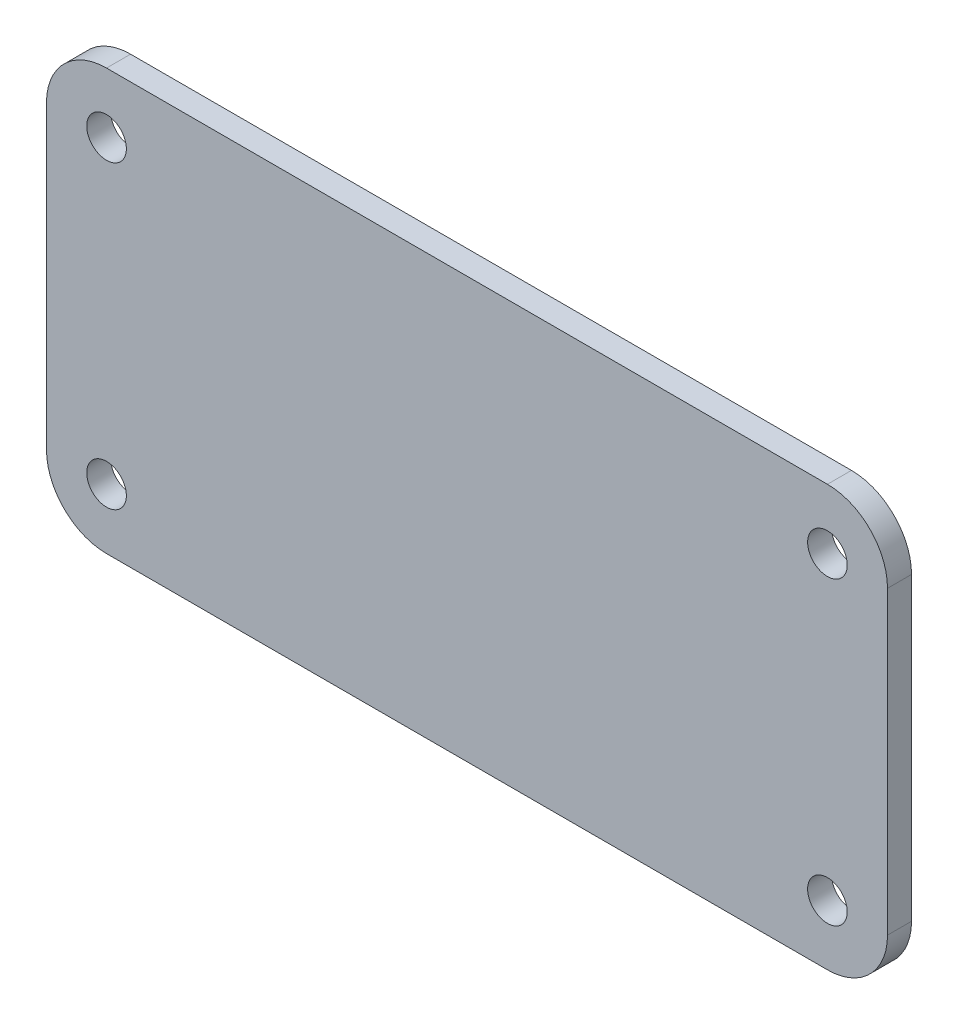
ISO-10303-21;
HEADER;
FILE_DESCRIPTION(('STEP AP214'),'2;1');
FILE_NAME('part.step','',(''),(''),'','','');
FILE_SCHEMA(('AUTOMOTIVE_DESIGN { 1 0 10303 214 1 1 1 1 }'));
ENDSEC;
DATA;
#1=APPLICATION_CONTEXT('core data for automotive mechanical design processes');
#2=APPLICATION_PROTOCOL_DEFINITION('international standard','automotive_design',2000,#1);
#3=PRODUCT_CONTEXT('',#1,'mechanical');
#4=PRODUCT('Part','Part','',(#3));
#5=PRODUCT_RELATED_PRODUCT_CATEGORY('part','',(#4));
#6=PRODUCT_DEFINITION_FORMATION('','',#4);
#7=PRODUCT_DEFINITION_CONTEXT('part definition',#1,'design');
#8=PRODUCT_DEFINITION('design','',#6,#7);
#9=PRODUCT_DEFINITION_SHAPE('','',#8);
#10=(LENGTH_UNIT() NAMED_UNIT(*) SI_UNIT(.MILLI.,.METRE.));
#11=(NAMED_UNIT(*) PLANE_ANGLE_UNIT() SI_UNIT($,.RADIAN.));
#12=(NAMED_UNIT(*) SI_UNIT($,.STERADIAN.) SOLID_ANGLE_UNIT());
#13=UNCERTAINTY_MEASURE_WITH_UNIT(LENGTH_MEASURE(1.E-05),#10,'distance_accuracy_value','');
#14=(GEOMETRIC_REPRESENTATION_CONTEXT(3) GLOBAL_UNCERTAINTY_ASSIGNED_CONTEXT((#13)) GLOBAL_UNIT_ASSIGNED_CONTEXT((#10,
#11,#12)) REPRESENTATION_CONTEXT('',''));
#15=CARTESIAN_POINT('',(0.,0.,0.));
#16=DIRECTION('',(0.,0.,1.));
#17=DIRECTION('',(1.,0.,0.));
#18=AXIS2_PLACEMENT_3D('',#15,#16,#17);
#19=CARTESIAN_POINT('',(0.,0.,2.));
#20=DIRECTION('',(1.,0.,0.));
#21=DIRECTION('',(0.,0.,-1.));
#22=AXIS2_PLACEMENT_3D('',#19,#20,#21);
#23=PLANE('',#22);
#24=DIRECTION('',(0.,-1.,0.));
#25=VECTOR('',#24,1.);
#26=CARTESIAN_POINT('',(0.,0.,0.));
#27=LINE('',#26,#25);
#28=CARTESIAN_POINT('',(0.,30.,0.));
#29=VERTEX_POINT('',#28);
#30=CARTESIAN_POINT('',(0.,5.,0.));
#31=VERTEX_POINT('',#30);
#32=EDGE_CURVE('E126',#29,#31,#27,.T.);
#33=ORIENTED_EDGE('',*,*,#32,.T.);
#34=DIRECTION('',(0.,0.,-1.));
#35=VECTOR('',#34,1.);
#36=CARTESIAN_POINT('',(0.,5.,2.));
#37=LINE('',#36,#35);
#38=CARTESIAN_POINT('',(0.,5.,2.));
#39=VERTEX_POINT('',#38);
#40=EDGE_CURVE('E104',#31,#39,#37,.F.);
#41=ORIENTED_EDGE('',*,*,#40,.T.);
#42=DIRECTION('',(0.,-1.,0.));
#43=VECTOR('',#42,1.);
#44=CARTESIAN_POINT('',(0.,0.,2.));
#45=LINE('',#44,#43);
#46=CARTESIAN_POINT('',(0.,30.,2.));
#47=VERTEX_POINT('',#46);
#48=EDGE_CURVE('E136',#47,#39,#45,.T.);
#49=ORIENTED_EDGE('',*,*,#48,.F.);
#50=DIRECTION('',(0.,0.,-1.));
#51=VECTOR('',#50,1.);
#52=CARTESIAN_POINT('',(0.,30.,2.));
#53=LINE('',#52,#51);
#54=EDGE_CURVE('E109',#47,#29,#53,.T.);
#55=ORIENTED_EDGE('',*,*,#54,.T.);
#56=EDGE_LOOP('',(#33,#41,#49,#55));
#57=FACE_BOUND('',#56,.T.);
#58=ADVANCED_FACE('F33',(#57),#23,.F.);
#59=CARTESIAN_POINT('',(0.,0.,2.));
#60=DIRECTION('',(0.,1.,0.));
#61=DIRECTION('',(0.,0.,1.));
#62=AXIS2_PLACEMENT_3D('',#59,#60,#61);
#63=PLANE('',#62);
#64=DIRECTION('',(1.,0.,0.));
#65=VECTOR('',#64,1.);
#66=CARTESIAN_POINT('',(0.,0.,2.));
#67=LINE('',#66,#65);
#68=CARTESIAN_POINT('',(5.,0.,2.));
#69=VERTEX_POINT('',#68);
#70=CARTESIAN_POINT('',(65.,0.,2.));
#71=VERTEX_POINT('',#70);
#72=EDGE_CURVE('E119',#69,#71,#67,.T.);
#73=ORIENTED_EDGE('',*,*,#72,.F.);
#74=DIRECTION('',(0.,0.,-1.));
#75=VECTOR('',#74,1.);
#76=CARTESIAN_POINT('',(5.,0.,2.));
#77=LINE('',#76,#75);
#78=CARTESIAN_POINT('',(5.,0.,0.));
#79=VERTEX_POINT('',#78);
#80=EDGE_CURVE('E103',#69,#79,#77,.T.);
#81=ORIENTED_EDGE('',*,*,#80,.T.);
#82=DIRECTION('',(1.,0.,0.));
#83=VECTOR('',#82,1.);
#84=CARTESIAN_POINT('',(0.,0.,0.));
#85=LINE('',#84,#83);
#86=CARTESIAN_POINT('',(65.,0.,0.));
#87=VERTEX_POINT('',#86);
#88=EDGE_CURVE('E116',#79,#87,#85,.T.);
#89=ORIENTED_EDGE('',*,*,#88,.T.);
#90=DIRECTION('',(0.,0.,-1.));
#91=VECTOR('',#90,1.);
#92=CARTESIAN_POINT('',(65.,0.,2.));
#93=LINE('',#92,#91);
#94=EDGE_CURVE('E121',#87,#71,#93,.F.);
#95=ORIENTED_EDGE('',*,*,#94,.T.);
#96=EDGE_LOOP('',(#73,#81,#89,#95));
#97=FACE_BOUND('',#96,.T.);
#98=ADVANCED_FACE('F115',(#97),#63,.F.);
#99=CARTESIAN_POINT('',(70.,0.,2.));
#100=DIRECTION('',(-1.,0.,0.));
#101=DIRECTION('',(0.,0.,1.));
#102=AXIS2_PLACEMENT_3D('',#99,#100,#101);
#103=PLANE('',#102);
#104=DIRECTION('',(0.,1.,0.));
#105=VECTOR('',#104,1.);
#106=CARTESIAN_POINT('',(70.,0.,2.));
#107=LINE('',#106,#105);
#108=CARTESIAN_POINT('',(70.,5.,2.));
#109=VERTEX_POINT('',#108);
#110=CARTESIAN_POINT('',(70.,30.,2.));
#111=VERTEX_POINT('',#110);
#112=EDGE_CURVE('E162',#109,#111,#107,.T.);
#113=ORIENTED_EDGE('',*,*,#112,.F.);
#114=DIRECTION('',(0.,0.,-1.));
#115=VECTOR('',#114,1.);
#116=CARTESIAN_POINT('',(70.,5.,2.));
#117=LINE('',#116,#115);
#118=CARTESIAN_POINT('',(70.,5.,0.));
#119=VERTEX_POINT('',#118);
#120=EDGE_CURVE('E155',#109,#119,#117,.T.);
#121=ORIENTED_EDGE('',*,*,#120,.T.);
#122=DIRECTION('',(0.,1.,0.));
#123=VECTOR('',#122,1.);
#124=CARTESIAN_POINT('',(70.,0.,0.));
#125=LINE('',#124,#123);
#126=CARTESIAN_POINT('',(70.,30.,0.));
#127=VERTEX_POINT('',#126);
#128=EDGE_CURVE('E125',#119,#127,#125,.T.);
#129=ORIENTED_EDGE('',*,*,#128,.T.);
#130=DIRECTION('',(0.,0.,-1.));
#131=VECTOR('',#130,1.);
#132=CARTESIAN_POINT('',(70.,30.,2.));
#133=LINE('',#132,#131);
#134=EDGE_CURVE('E153',#127,#111,#133,.F.);
#135=ORIENTED_EDGE('',*,*,#134,.T.);
#136=EDGE_LOOP('',(#113,#121,#129,#135));
#137=FACE_BOUND('',#136,.T.);
#138=ADVANCED_FACE('F160',(#137),#103,.F.);
#139=CARTESIAN_POINT('',(0.,35.,2.));
#140=DIRECTION('',(0.,-1.,0.));
#141=DIRECTION('',(0.,0.,-1.));
#142=AXIS2_PLACEMENT_3D('',#139,#140,#141);
#143=PLANE('',#142);
#144=DIRECTION('',(-1.,0.,0.));
#145=VECTOR('',#144,1.);
#146=CARTESIAN_POINT('',(0.,35.,2.));
#147=LINE('',#146,#145);
#148=CARTESIAN_POINT('',(65.,35.,2.));
#149=VERTEX_POINT('',#148);
#150=CARTESIAN_POINT('',(5.,35.,2.));
#151=VERTEX_POINT('',#150);
#152=EDGE_CURVE('E137',#149,#151,#147,.T.);
#153=ORIENTED_EDGE('',*,*,#152,.F.);
#154=DIRECTION('',(0.,0.,-1.));
#155=VECTOR('',#154,1.);
#156=CARTESIAN_POINT('',(65.,35.,2.));
#157=LINE('',#156,#155);
#158=CARTESIAN_POINT('',(65.,35.,0.));
#159=VERTEX_POINT('',#158);
#160=EDGE_CURVE('E11',#149,#159,#157,.T.);
#161=ORIENTED_EDGE('',*,*,#160,.T.);
#162=DIRECTION('',(-1.,0.,0.));
#163=VECTOR('',#162,1.);
#164=CARTESIAN_POINT('',(0.,35.,0.));
#165=LINE('',#164,#163);
#166=CARTESIAN_POINT('',(5.,35.,0.));
#167=VERTEX_POINT('',#166);
#168=EDGE_CURVE('E129',#159,#167,#165,.T.);
#169=ORIENTED_EDGE('',*,*,#168,.T.);
#170=DIRECTION('',(0.,0.,-1.));
#171=VECTOR('',#170,1.);
#172=CARTESIAN_POINT('',(5.,35.,2.));
#173=LINE('',#172,#171);
#174=EDGE_CURVE('E41',#167,#151,#173,.F.);
#175=ORIENTED_EDGE('',*,*,#174,.T.);
#176=EDGE_LOOP('',(#153,#161,#169,#175));
#177=FACE_BOUND('',#176,.T.);
#178=ADVANCED_FACE('F169',(#177),#143,.F.);
#179=CARTESIAN_POINT('',(0.,0.,2.));
#180=DIRECTION('',(0.,0.,-1.));
#181=DIRECTION('',(-1.,0.,0.));
#182=AXIS2_PLACEMENT_3D('',#179,#180,#181);
#183=PLANE('',#182);
#184=CARTESIAN_POINT('',(5.,5.,2.));
#185=DIRECTION('',(0.,0.,1.));
#186=DIRECTION('',(1.,0.,0.));
#187=AXIS2_PLACEMENT_3D('',#184,#185,#186);
#188=CIRCLE('',#187,1.65);
#189=CARTESIAN_POINT('',(6.65,5.,2.));
#190=VERTEX_POINT('',#189);
#191=EDGE_CURVE('E179',#190,#190,#188,.T.);
#192=ORIENTED_EDGE('',*,*,#191,.F.);
#193=EDGE_LOOP('',(#192));
#194=FACE_BOUND('',#193,.T.);
#195=CARTESIAN_POINT('',(65.,30.,2.));
#196=DIRECTION('',(0.,0.,1.));
#197=DIRECTION('',(1.,0.,0.));
#198=AXIS2_PLACEMENT_3D('',#195,#196,#197);
#199=CIRCLE('',#198,1.65);
#200=CARTESIAN_POINT('',(66.65,30.,2.));
#201=VERTEX_POINT('',#200);
#202=EDGE_CURVE('E185',#201,#201,#199,.T.);
#203=ORIENTED_EDGE('',*,*,#202,.F.);
#204=EDGE_LOOP('',(#203));
#205=FACE_BOUND('',#204,.T.);
#206=CARTESIAN_POINT('',(65.,5.,2.));
#207=DIRECTION('',(0.,0.,1.));
#208=DIRECTION('',(1.,0.,0.));
#209=AXIS2_PLACEMENT_3D('',#206,#207,#208);
#210=CIRCLE('',#209,1.65);
#211=CARTESIAN_POINT('',(66.65,5.,2.));
#212=VERTEX_POINT('',#211);
#213=EDGE_CURVE('E186',#212,#212,#210,.T.);
#214=ORIENTED_EDGE('',*,*,#213,.F.);
#215=EDGE_LOOP('',(#214));
#216=FACE_BOUND('',#215,.T.);
#217=CARTESIAN_POINT('',(5.,30.,2.));
#218=DIRECTION('',(0.,0.,1.));
#219=DIRECTION('',(1.,0.,0.));
#220=AXIS2_PLACEMENT_3D('',#217,#218,#219);
#221=CIRCLE('',#220,1.65);
#222=CARTESIAN_POINT('',(6.65,30.,2.));
#223=VERTEX_POINT('',#222);
#224=EDGE_CURVE('E176',#223,#223,#221,.T.);
#225=ORIENTED_EDGE('',*,*,#224,.F.);
#226=EDGE_LOOP('',(#225));
#227=FACE_BOUND('',#226,.T.);
#228=ORIENTED_EDGE('',*,*,#48,.T.);
#229=CARTESIAN_POINT('',(5.,5.,2.));
#230=DIRECTION('',(0.,0.,-1.));
#231=DIRECTION('',(-1.,0.,0.));
#232=AXIS2_PLACEMENT_3D('',#229,#230,#231);
#233=CIRCLE('',#232,5.);
#234=EDGE_CURVE('E151',#39,#69,#233,.F.);
#235=ORIENTED_EDGE('',*,*,#234,.T.);
#236=ORIENTED_EDGE('',*,*,#72,.T.);
#237=CARTESIAN_POINT('',(65.,5.,2.));
#238=DIRECTION('',(0.,0.,-1.));
#239=DIRECTION('',(-1.,0.,0.));
#240=AXIS2_PLACEMENT_3D('',#237,#238,#239);
#241=CIRCLE('',#240,5.);
#242=EDGE_CURVE('E149',#71,#109,#241,.F.);
#243=ORIENTED_EDGE('',*,*,#242,.T.);
#244=ORIENTED_EDGE('',*,*,#112,.T.);
#245=CARTESIAN_POINT('',(65.,30.,2.));
#246=DIRECTION('',(0.,0.,-1.));
#247=DIRECTION('',(-1.,0.,0.));
#248=AXIS2_PLACEMENT_3D('',#245,#246,#247);
#249=CIRCLE('',#248,5.);
#250=EDGE_CURVE('E54',#111,#149,#249,.F.);
#251=ORIENTED_EDGE('',*,*,#250,.T.);
#252=ORIENTED_EDGE('',*,*,#152,.T.);
#253=CARTESIAN_POINT('',(5.,30.,2.));
#254=DIRECTION('',(0.,0.,-1.));
#255=DIRECTION('',(-1.,0.,0.));
#256=AXIS2_PLACEMENT_3D('',#253,#254,#255);
#257=CIRCLE('',#256,5.);
#258=EDGE_CURVE('E146',#151,#47,#257,.F.);
#259=ORIENTED_EDGE('',*,*,#258,.T.);
#260=EDGE_LOOP('',(#228,#235,#236,#243,#244,#251,#252,#259));
#261=FACE_BOUND('',#260,.T.);
#262=ADVANCED_FACE('F202',(#194,#205,#216,#227,#261),#183,.F.);
#263=CARTESIAN_POINT('',(0.,0.,0.));
#264=DIRECTION('',(0.,0.,-1.));
#265=DIRECTION('',(-1.,0.,0.));
#266=AXIS2_PLACEMENT_3D('',#263,#264,#265);
#267=PLANE('',#266);
#268=CARTESIAN_POINT('',(5.,5.,0.));
#269=DIRECTION('',(0.,0.,1.));
#270=DIRECTION('',(1.,0.,0.));
#271=AXIS2_PLACEMENT_3D('',#268,#269,#270);
#272=CIRCLE('',#271,1.65);
#273=CARTESIAN_POINT('',(6.65,5.,0.));
#274=VERTEX_POINT('',#273);
#275=EDGE_CURVE('E189',#274,#274,#272,.T.);
#276=ORIENTED_EDGE('',*,*,#275,.T.);
#277=EDGE_LOOP('',(#276));
#278=FACE_BOUND('',#277,.T.);
#279=CARTESIAN_POINT('',(65.,30.,0.));
#280=DIRECTION('',(0.,0.,1.));
#281=DIRECTION('',(1.,0.,0.));
#282=AXIS2_PLACEMENT_3D('',#279,#280,#281);
#283=CIRCLE('',#282,1.65);
#284=CARTESIAN_POINT('',(66.65,30.,0.));
#285=VERTEX_POINT('',#284);
#286=EDGE_CURVE('E182',#285,#285,#283,.T.);
#287=ORIENTED_EDGE('',*,*,#286,.T.);
#288=EDGE_LOOP('',(#287));
#289=FACE_BOUND('',#288,.T.);
#290=CARTESIAN_POINT('',(65.,5.,0.));
#291=DIRECTION('',(0.,0.,1.));
#292=DIRECTION('',(1.,0.,0.));
#293=AXIS2_PLACEMENT_3D('',#290,#291,#292);
#294=CIRCLE('',#293,1.65);
#295=CARTESIAN_POINT('',(66.65,5.,0.));
#296=VERTEX_POINT('',#295);
#297=EDGE_CURVE('E194',#296,#296,#294,.T.);
#298=ORIENTED_EDGE('',*,*,#297,.T.);
#299=EDGE_LOOP('',(#298));
#300=FACE_BOUND('',#299,.T.);
#301=CARTESIAN_POINT('',(5.,30.,0.));
#302=DIRECTION('',(0.,0.,1.));
#303=DIRECTION('',(1.,0.,0.));
#304=AXIS2_PLACEMENT_3D('',#301,#302,#303);
#305=CIRCLE('',#304,1.65);
#306=CARTESIAN_POINT('',(6.65,30.,0.));
#307=VERTEX_POINT('',#306);
#308=EDGE_CURVE('E131',#307,#307,#305,.T.);
#309=ORIENTED_EDGE('',*,*,#308,.T.);
#310=EDGE_LOOP('',(#309));
#311=FACE_BOUND('',#310,.T.);
#312=ORIENTED_EDGE('',*,*,#88,.F.);
#313=CARTESIAN_POINT('',(5.,5.,0.));
#314=DIRECTION('',(0.,0.,-1.));
#315=DIRECTION('',(-1.,0.,0.));
#316=AXIS2_PLACEMENT_3D('',#313,#314,#315);
#317=CIRCLE('',#316,5.);
#318=EDGE_CURVE('E99',#79,#31,#317,.T.);
#319=ORIENTED_EDGE('',*,*,#318,.T.);
#320=ORIENTED_EDGE('',*,*,#32,.F.);
#321=CARTESIAN_POINT('',(5.,30.,0.));
#322=DIRECTION('',(0.,0.,-1.));
#323=DIRECTION('',(-1.,0.,0.));
#324=AXIS2_PLACEMENT_3D('',#321,#322,#323);
#325=CIRCLE('',#324,5.);
#326=EDGE_CURVE('E120',#29,#167,#325,.T.);
#327=ORIENTED_EDGE('',*,*,#326,.T.);
#328=ORIENTED_EDGE('',*,*,#168,.F.);
#329=CARTESIAN_POINT('',(65.,30.,0.));
#330=DIRECTION('',(0.,0.,-1.));
#331=DIRECTION('',(-1.,0.,0.));
#332=AXIS2_PLACEMENT_3D('',#329,#330,#331);
#333=CIRCLE('',#332,5.);
#334=EDGE_CURVE('E140',#159,#127,#333,.T.);
#335=ORIENTED_EDGE('',*,*,#334,.T.);
#336=ORIENTED_EDGE('',*,*,#128,.F.);
#337=CARTESIAN_POINT('',(65.,5.,0.));
#338=DIRECTION('',(0.,0.,-1.));
#339=DIRECTION('',(-1.,0.,0.));
#340=AXIS2_PLACEMENT_3D('',#337,#338,#339);
#341=CIRCLE('',#340,5.);
#342=EDGE_CURVE('E110',#119,#87,#341,.T.);
#343=ORIENTED_EDGE('',*,*,#342,.T.);
#344=EDGE_LOOP('',(#312,#319,#320,#327,#328,#335,#336,#343));
#345=FACE_BOUND('',#344,.T.);
#346=ADVANCED_FACE('F123',(#278,#289,#300,#311,#345),#267,.T.);
#347=CARTESIAN_POINT('',(5.,5.,2.));
#348=DIRECTION('',(0.,0.,-1.));
#349=DIRECTION('',(-1.,0.,0.));
#350=AXIS2_PLACEMENT_3D('',#347,#348,#349);
#351=CYLINDRICAL_SURFACE('',#350,5.);
#352=ORIENTED_EDGE('',*,*,#234,.F.);
#353=ORIENTED_EDGE('',*,*,#40,.F.);
#354=ORIENTED_EDGE('',*,*,#318,.F.);
#355=ORIENTED_EDGE('',*,*,#80,.F.);
#356=EDGE_LOOP('',(#352,#353,#354,#355));
#357=FACE_BOUND('',#356,.T.);
#358=ADVANCED_FACE('F102',(#357),#351,.T.);
#359=CARTESIAN_POINT('',(65.,5.,2.));
#360=DIRECTION('',(0.,0.,-1.));
#361=DIRECTION('',(-1.,0.,0.));
#362=AXIS2_PLACEMENT_3D('',#359,#360,#361);
#363=CYLINDRICAL_SURFACE('',#362,5.);
#364=ORIENTED_EDGE('',*,*,#242,.F.);
#365=ORIENTED_EDGE('',*,*,#94,.F.);
#366=ORIENTED_EDGE('',*,*,#342,.F.);
#367=ORIENTED_EDGE('',*,*,#120,.F.);
#368=EDGE_LOOP('',(#364,#365,#366,#367));
#369=FACE_BOUND('',#368,.T.);
#370=ADVANCED_FACE('F220',(#369),#363,.T.);
#371=CARTESIAN_POINT('',(65.,30.,2.));
#372=DIRECTION('',(0.,0.,-1.));
#373=DIRECTION('',(-1.,0.,0.));
#374=AXIS2_PLACEMENT_3D('',#371,#372,#373);
#375=CYLINDRICAL_SURFACE('',#374,5.);
#376=ORIENTED_EDGE('',*,*,#250,.F.);
#377=ORIENTED_EDGE('',*,*,#134,.F.);
#378=ORIENTED_EDGE('',*,*,#334,.F.);
#379=ORIENTED_EDGE('',*,*,#160,.F.);
#380=EDGE_LOOP('',(#376,#377,#378,#379));
#381=FACE_BOUND('',#380,.T.);
#382=ADVANCED_FACE('F168',(#381),#375,.T.);
#383=CARTESIAN_POINT('',(5.,30.,2.));
#384=DIRECTION('',(0.,0.,-1.));
#385=DIRECTION('',(-1.,0.,0.));
#386=AXIS2_PLACEMENT_3D('',#383,#384,#385);
#387=CYLINDRICAL_SURFACE('',#386,5.);
#388=ORIENTED_EDGE('',*,*,#258,.F.);
#389=ORIENTED_EDGE('',*,*,#174,.F.);
#390=ORIENTED_EDGE('',*,*,#326,.F.);
#391=ORIENTED_EDGE('',*,*,#54,.F.);
#392=EDGE_LOOP('',(#388,#389,#390,#391));
#393=FACE_BOUND('',#392,.T.);
#394=ADVANCED_FACE('F35',(#393),#387,.T.);
#395=CARTESIAN_POINT('',(5.,30.,0.));
#396=DIRECTION('',(0.,0.,1.));
#397=DIRECTION('',(1.,0.,0.));
#398=AXIS2_PLACEMENT_3D('',#395,#396,#397);
#399=CYLINDRICAL_SURFACE('',#398,1.65);
#400=ORIENTED_EDGE('',*,*,#308,.F.);
#401=EDGE_LOOP('',(#400));
#402=FACE_BOUND('',#401,.T.);
#403=ORIENTED_EDGE('',*,*,#224,.T.);
#404=EDGE_LOOP('',(#403));
#405=FACE_BOUND('',#404,.T.);
#406=ADVANCED_FACE('F213',(#402,#405),#399,.F.);
#407=CARTESIAN_POINT('',(65.,5.,0.));
#408=DIRECTION('',(0.,0.,1.));
#409=DIRECTION('',(1.,0.,0.));
#410=AXIS2_PLACEMENT_3D('',#407,#408,#409);
#411=CYLINDRICAL_SURFACE('',#410,1.65);
#412=ORIENTED_EDGE('',*,*,#297,.F.);
#413=EDGE_LOOP('',(#412));
#414=FACE_BOUND('',#413,.T.);
#415=ORIENTED_EDGE('',*,*,#213,.T.);
#416=EDGE_LOOP('',(#415));
#417=FACE_BOUND('',#416,.T.);
#418=ADVANCED_FACE('F200',(#414,#417),#411,.F.);
#419=CARTESIAN_POINT('',(65.,30.,0.));
#420=DIRECTION('',(0.,0.,1.));
#421=DIRECTION('',(1.,0.,0.));
#422=AXIS2_PLACEMENT_3D('',#419,#420,#421);
#423=CYLINDRICAL_SURFACE('',#422,1.65);
#424=ORIENTED_EDGE('',*,*,#286,.F.);
#425=EDGE_LOOP('',(#424));
#426=FACE_BOUND('',#425,.T.);
#427=ORIENTED_EDGE('',*,*,#202,.T.);
#428=EDGE_LOOP('',(#427));
#429=FACE_BOUND('',#428,.T.);
#430=ADVANCED_FACE('F277',(#426,#429),#423,.F.);
#431=CARTESIAN_POINT('',(5.,5.,0.));
#432=DIRECTION('',(0.,0.,1.));
#433=DIRECTION('',(1.,0.,0.));
#434=AXIS2_PLACEMENT_3D('',#431,#432,#433);
#435=CYLINDRICAL_SURFACE('',#434,1.65);
#436=ORIENTED_EDGE('',*,*,#275,.F.);
#437=EDGE_LOOP('',(#436));
#438=FACE_BOUND('',#437,.T.);
#439=ORIENTED_EDGE('',*,*,#191,.T.);
#440=EDGE_LOOP('',(#439));
#441=FACE_BOUND('',#440,.T.);
#442=ADVANCED_FACE('F287',(#438,#441),#435,.F.);
#443=CLOSED_SHELL('',(#58,#98,#138,#178,#262,#346,#358,#370,#382,#394,#406,#418,#430,#442));
#444=MANIFOLD_SOLID_BREP('B2',#443);
#445=ADVANCED_BREP_SHAPE_REPRESENTATION('',(#18,#444),#14);
#446=SHAPE_DEFINITION_REPRESENTATION(#9,#445);
ENDSEC;
END-ISO-10303-21;
